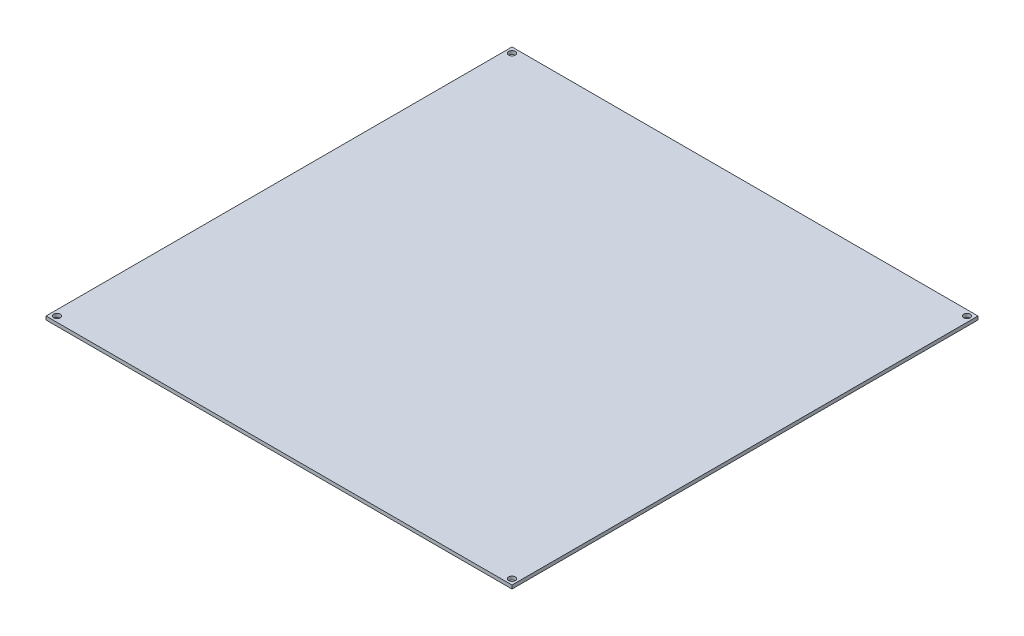
ISO-10303-21;
HEADER;
FILE_DESCRIPTION(('STEP AP214'),'2;1');
FILE_NAME('part.step','',(''),(''),'','','');
FILE_SCHEMA(('AUTOMOTIVE_DESIGN { 1 0 10303 214 1 1 1 1 }'));
ENDSEC;
DATA;
#1=APPLICATION_CONTEXT('core data for automotive mechanical design processes');
#2=APPLICATION_PROTOCOL_DEFINITION('international standard','automotive_design',2000,#1);
#3=PRODUCT_CONTEXT('',#1,'mechanical');
#4=PRODUCT('Part','Part','',(#3));
#5=PRODUCT_RELATED_PRODUCT_CATEGORY('part','',(#4));
#6=PRODUCT_DEFINITION_FORMATION('','',#4);
#7=PRODUCT_DEFINITION_CONTEXT('part definition',#1,'design');
#8=PRODUCT_DEFINITION('design','',#6,#7);
#9=PRODUCT_DEFINITION_SHAPE('','',#8);
#10=(LENGTH_UNIT() NAMED_UNIT(*) SI_UNIT(.MILLI.,.METRE.));
#11=(NAMED_UNIT(*) PLANE_ANGLE_UNIT() SI_UNIT($,.RADIAN.));
#12=(NAMED_UNIT(*) SI_UNIT($,.STERADIAN.) SOLID_ANGLE_UNIT());
#13=UNCERTAINTY_MEASURE_WITH_UNIT(LENGTH_MEASURE(1.E-05),#10,'distance_accuracy_value','');
#14=(GEOMETRIC_REPRESENTATION_CONTEXT(3) GLOBAL_UNCERTAINTY_ASSIGNED_CONTEXT((#13)) GLOBAL_UNIT_ASSIGNED_CONTEXT((#10,
#11,#12)) REPRESENTATION_CONTEXT('',''));
#15=CARTESIAN_POINT('',(0.,0.,0.));
#16=DIRECTION('',(0.,0.,1.));
#17=DIRECTION('',(1.,0.,0.));
#18=AXIS2_PLACEMENT_3D('',#15,#16,#17);
#19=CARTESIAN_POINT('',(0.,-5.4,0.));
#20=DIRECTION('',(0.,1.,0.));
#21=DIRECTION('',(0.,0.,1.));
#22=AXIS2_PLACEMENT_3D('',#19,#20,#21);
#23=PLANE('',#22);
#24=CARTESIAN_POINT('',(-104.5,-5.4,-104.5));
#25=DIRECTION('',(0.,1.,0.));
#26=DIRECTION('',(0.,0.,1.));
#27=AXIS2_PLACEMENT_3D('',#24,#25,#26);
#28=CIRCLE('',#27,1.5);
#29=CARTESIAN_POINT('',(-104.5,-5.4,-103.));
#30=VERTEX_POINT('',#29);
#31=EDGE_CURVE('E121',#30,#30,#28,.T.);
#32=ORIENTED_EDGE('',*,*,#31,.F.);
#33=EDGE_LOOP('',(#32));
#34=FACE_BOUND('',#33,.T.);
#35=CARTESIAN_POINT('',(104.5,-5.4,-104.5));
#36=DIRECTION('',(0.,1.,0.));
#37=DIRECTION('',(0.,0.,1.));
#38=AXIS2_PLACEMENT_3D('',#35,#36,#37);
#39=CIRCLE('',#38,1.5);
#40=CARTESIAN_POINT('',(104.5,-5.4,-103.));
#41=VERTEX_POINT('',#40);
#42=EDGE_CURVE('E100',#41,#41,#39,.T.);
#43=ORIENTED_EDGE('',*,*,#42,.F.);
#44=EDGE_LOOP('',(#43));
#45=FACE_BOUND('',#44,.T.);
#46=DIRECTION('',(0.,0.,1.));
#47=VECTOR('',#46,1.);
#48=CARTESIAN_POINT('',(-107.,-5.4,-107.));
#49=LINE('',#48,#47);
#50=CARTESIAN_POINT('',(-107.,-5.4,-107.));
#51=VERTEX_POINT('',#50);
#52=CARTESIAN_POINT('',(-107.,-5.4,107.));
#53=VERTEX_POINT('',#52);
#54=EDGE_CURVE('E85',#51,#53,#49,.T.);
#55=ORIENTED_EDGE('',*,*,#54,.T.);
#56=DIRECTION('',(1.,0.,0.));
#57=VECTOR('',#56,1.);
#58=CARTESIAN_POINT('',(-107.,-5.4,107.));
#59=LINE('',#58,#57);
#60=CARTESIAN_POINT('',(107.,-5.4,107.));
#61=VERTEX_POINT('',#60);
#62=EDGE_CURVE('E80',#53,#61,#59,.T.);
#63=ORIENTED_EDGE('',*,*,#62,.T.);
#64=DIRECTION('',(0.,0.,-1.));
#65=VECTOR('',#64,1.);
#66=CARTESIAN_POINT('',(107.,-5.4,-107.));
#67=LINE('',#66,#65);
#68=CARTESIAN_POINT('',(107.,-5.4,-107.));
#69=VERTEX_POINT('',#68);
#70=EDGE_CURVE('E83',#61,#69,#67,.T.);
#71=ORIENTED_EDGE('',*,*,#70,.T.);
#72=DIRECTION('',(-1.,0.,0.));
#73=VECTOR('',#72,1.);
#74=CARTESIAN_POINT('',(-107.,-5.4,-107.));
#75=LINE('',#74,#73);
#76=EDGE_CURVE('E50',#69,#51,#75,.T.);
#77=ORIENTED_EDGE('',*,*,#76,.T.);
#78=EDGE_LOOP('',(#55,#63,#71,#77));
#79=FACE_BOUND('',#78,.T.);
#80=CARTESIAN_POINT('',(104.5,-5.4,104.5));
#81=DIRECTION('',(0.,1.,0.));
#82=DIRECTION('',(0.,0.,1.));
#83=AXIS2_PLACEMENT_3D('',#80,#81,#82);
#84=CIRCLE('',#83,1.5);
#85=CARTESIAN_POINT('',(104.5,-5.4,106.));
#86=VERTEX_POINT('',#85);
#87=EDGE_CURVE('E115',#86,#86,#84,.T.);
#88=ORIENTED_EDGE('',*,*,#87,.F.);
#89=EDGE_LOOP('',(#88));
#90=FACE_BOUND('',#89,.T.);
#91=CARTESIAN_POINT('',(-104.5,-5.4,104.5));
#92=DIRECTION('',(0.,1.,0.));
#93=DIRECTION('',(0.,0.,1.));
#94=AXIS2_PLACEMENT_3D('',#91,#92,#93);
#95=CIRCLE('',#94,1.5);
#96=CARTESIAN_POINT('',(-104.5,-5.4,106.));
#97=VERTEX_POINT('',#96);
#98=EDGE_CURVE('E127',#97,#97,#95,.T.);
#99=ORIENTED_EDGE('',*,*,#98,.F.);
#100=EDGE_LOOP('',(#99));
#101=FACE_BOUND('',#100,.T.);
#102=ADVANCED_FACE('F33',(#34,#45,#79,#90,#101),#23,.T.);
#103=CARTESIAN_POINT('',(0.,-7.,0.));
#104=DIRECTION('',(0.,1.,0.));
#105=DIRECTION('',(0.,0.,1.));
#106=AXIS2_PLACEMENT_3D('',#103,#104,#105);
#107=PLANE('',#106);
#108=CARTESIAN_POINT('',(-104.5,-7.,-104.5));
#109=DIRECTION('',(0.,1.,0.));
#110=DIRECTION('',(0.,0.,1.));
#111=AXIS2_PLACEMENT_3D('',#108,#109,#110);
#112=CIRCLE('',#111,1.5);
#113=CARTESIAN_POINT('',(-104.5,-7.,-103.));
#114=VERTEX_POINT('',#113);
#115=EDGE_CURVE('E124',#114,#114,#112,.T.);
#116=ORIENTED_EDGE('',*,*,#115,.T.);
#117=EDGE_LOOP('',(#116));
#118=FACE_BOUND('',#117,.T.);
#119=CARTESIAN_POINT('',(104.5,-7.,-104.5));
#120=DIRECTION('',(0.,1.,0.));
#121=DIRECTION('',(0.,0.,1.));
#122=AXIS2_PLACEMENT_3D('',#119,#120,#121);
#123=CIRCLE('',#122,1.5);
#124=CARTESIAN_POINT('',(104.5,-7.,-103.));
#125=VERTEX_POINT('',#124);
#126=EDGE_CURVE('E112',#125,#125,#123,.T.);
#127=ORIENTED_EDGE('',*,*,#126,.T.);
#128=EDGE_LOOP('',(#127));
#129=FACE_BOUND('',#128,.T.);
#130=DIRECTION('',(0.,0.,1.));
#131=VECTOR('',#130,1.);
#132=CARTESIAN_POINT('',(-107.,-7.,-107.));
#133=LINE('',#132,#131);
#134=CARTESIAN_POINT('',(-107.,-7.,-107.));
#135=VERTEX_POINT('',#134);
#136=CARTESIAN_POINT('',(-107.,-7.,107.));
#137=VERTEX_POINT('',#136);
#138=EDGE_CURVE('E97',#135,#137,#133,.T.);
#139=ORIENTED_EDGE('',*,*,#138,.F.);
#140=DIRECTION('',(-1.,0.,0.));
#141=VECTOR('',#140,1.);
#142=CARTESIAN_POINT('',(-107.,-7.,-107.));
#143=LINE('',#142,#141);
#144=CARTESIAN_POINT('',(107.,-7.,-107.));
#145=VERTEX_POINT('',#144);
#146=EDGE_CURVE('E73',#145,#135,#143,.T.);
#147=ORIENTED_EDGE('',*,*,#146,.F.);
#148=DIRECTION('',(0.,0.,-1.));
#149=VECTOR('',#148,1.);
#150=CARTESIAN_POINT('',(107.,-7.,-107.));
#151=LINE('',#150,#149);
#152=CARTESIAN_POINT('',(107.,-7.,107.));
#153=VERTEX_POINT('',#152);
#154=EDGE_CURVE('E67',#153,#145,#151,.T.);
#155=ORIENTED_EDGE('',*,*,#154,.F.);
#156=DIRECTION('',(1.,0.,0.));
#157=VECTOR('',#156,1.);
#158=CARTESIAN_POINT('',(-107.,-7.,107.));
#159=LINE('',#158,#157);
#160=EDGE_CURVE('E89',#137,#153,#159,.T.);
#161=ORIENTED_EDGE('',*,*,#160,.F.);
#162=EDGE_LOOP('',(#139,#147,#155,#161));
#163=FACE_BOUND('',#162,.T.);
#164=CARTESIAN_POINT('',(104.5,-7.,104.5));
#165=DIRECTION('',(0.,1.,0.));
#166=DIRECTION('',(0.,0.,1.));
#167=AXIS2_PLACEMENT_3D('',#164,#165,#166);
#168=CIRCLE('',#167,1.5);
#169=CARTESIAN_POINT('',(104.5,-7.,106.));
#170=VERTEX_POINT('',#169);
#171=EDGE_CURVE('E118',#170,#170,#168,.T.);
#172=ORIENTED_EDGE('',*,*,#171,.T.);
#173=EDGE_LOOP('',(#172));
#174=FACE_BOUND('',#173,.T.);
#175=CARTESIAN_POINT('',(-104.5,-7.,104.5));
#176=DIRECTION('',(0.,1.,0.));
#177=DIRECTION('',(0.,0.,1.));
#178=AXIS2_PLACEMENT_3D('',#175,#176,#177);
#179=CIRCLE('',#178,1.5);
#180=CARTESIAN_POINT('',(-104.5,-7.,106.));
#181=VERTEX_POINT('',#180);
#182=EDGE_CURVE('E130',#181,#181,#179,.T.);
#183=ORIENTED_EDGE('',*,*,#182,.T.);
#184=EDGE_LOOP('',(#183));
#185=FACE_BOUND('',#184,.T.);
#186=ADVANCED_FACE('F108',(#118,#129,#163,#174,#185),#107,.F.);
#187=CARTESIAN_POINT('',(-107.,-5.4,-107.));
#188=DIRECTION('',(1.,0.,0.));
#189=DIRECTION('',(0.,0.,-1.));
#190=AXIS2_PLACEMENT_3D('',#187,#188,#189);
#191=PLANE('',#190);
#192=ORIENTED_EDGE('',*,*,#138,.T.);
#193=DIRECTION('',(0.,-1.,0.));
#194=VECTOR('',#193,1.);
#195=CARTESIAN_POINT('',(-107.,-5.4,107.));
#196=LINE('',#195,#194);
#197=EDGE_CURVE('E11',#53,#137,#196,.T.);
#198=ORIENTED_EDGE('',*,*,#197,.F.);
#199=ORIENTED_EDGE('',*,*,#54,.F.);
#200=DIRECTION('',(0.,-1.,0.));
#201=VECTOR('',#200,1.);
#202=CARTESIAN_POINT('',(-107.,-5.4,-107.));
#203=LINE('',#202,#201);
#204=EDGE_CURVE('E93',#51,#135,#203,.T.);
#205=ORIENTED_EDGE('',*,*,#204,.T.);
#206=EDGE_LOOP('',(#192,#198,#199,#205));
#207=FACE_BOUND('',#206,.T.);
#208=ADVANCED_FACE('F35',(#207),#191,.F.);
#209=CARTESIAN_POINT('',(-107.,-5.4,107.));
#210=DIRECTION('',(0.,0.,-1.));
#211=DIRECTION('',(-1.,0.,0.));
#212=AXIS2_PLACEMENT_3D('',#209,#210,#211);
#213=PLANE('',#212);
#214=ORIENTED_EDGE('',*,*,#160,.T.);
#215=DIRECTION('',(0.,-1.,0.));
#216=VECTOR('',#215,1.);
#217=CARTESIAN_POINT('',(107.,-5.4,107.));
#218=LINE('',#217,#216);
#219=EDGE_CURVE('E42',#61,#153,#218,.T.);
#220=ORIENTED_EDGE('',*,*,#219,.F.);
#221=ORIENTED_EDGE('',*,*,#62,.F.);
#222=ORIENTED_EDGE('',*,*,#197,.T.);
#223=EDGE_LOOP('',(#214,#220,#221,#222));
#224=FACE_BOUND('',#223,.T.);
#225=ADVANCED_FACE('F88',(#224),#213,.F.);
#226=CARTESIAN_POINT('',(107.,-5.4,-107.));
#227=DIRECTION('',(-1.,0.,0.));
#228=DIRECTION('',(0.,0.,1.));
#229=AXIS2_PLACEMENT_3D('',#226,#227,#228);
#230=PLANE('',#229);
#231=ORIENTED_EDGE('',*,*,#154,.T.);
#232=DIRECTION('',(0.,-1.,0.));
#233=VECTOR('',#232,1.);
#234=CARTESIAN_POINT('',(107.,-5.4,-107.));
#235=LINE('',#234,#233);
#236=EDGE_CURVE('E90',#69,#145,#235,.T.);
#237=ORIENTED_EDGE('',*,*,#236,.F.);
#238=ORIENTED_EDGE('',*,*,#70,.F.);
#239=ORIENTED_EDGE('',*,*,#219,.T.);
#240=EDGE_LOOP('',(#231,#237,#238,#239));
#241=FACE_BOUND('',#240,.T.);
#242=ADVANCED_FACE('F91',(#241),#230,.F.);
#243=CARTESIAN_POINT('',(-107.,-5.4,-107.));
#244=DIRECTION('',(0.,0.,1.));
#245=DIRECTION('',(1.,0.,0.));
#246=AXIS2_PLACEMENT_3D('',#243,#244,#245);
#247=PLANE('',#246);
#248=ORIENTED_EDGE('',*,*,#146,.T.);
#249=ORIENTED_EDGE('',*,*,#204,.F.);
#250=ORIENTED_EDGE('',*,*,#76,.F.);
#251=ORIENTED_EDGE('',*,*,#236,.T.);
#252=EDGE_LOOP('',(#248,#249,#250,#251));
#253=FACE_BOUND('',#252,.T.);
#254=ADVANCED_FACE('F105',(#253),#247,.F.);
#255=CARTESIAN_POINT('',(104.5,-5.4,-104.5));
#256=DIRECTION('',(0.,-1.,0.));
#257=DIRECTION('',(0.,0.,-1.));
#258=AXIS2_PLACEMENT_3D('',#255,#256,#257);
#259=CYLINDRICAL_SURFACE('',#258,1.5);
#260=ORIENTED_EDGE('',*,*,#42,.T.);
#261=EDGE_LOOP('',(#260));
#262=FACE_BOUND('',#261,.T.);
#263=ORIENTED_EDGE('',*,*,#126,.F.);
#264=EDGE_LOOP('',(#263));
#265=FACE_BOUND('',#264,.T.);
#266=ADVANCED_FACE('F150',(#262,#265),#259,.F.);
#267=CARTESIAN_POINT('',(104.5,-5.4,104.5));
#268=DIRECTION('',(0.,-1.,0.));
#269=DIRECTION('',(0.,0.,-1.));
#270=AXIS2_PLACEMENT_3D('',#267,#268,#269);
#271=CYLINDRICAL_SURFACE('',#270,1.5);
#272=ORIENTED_EDGE('',*,*,#87,.T.);
#273=EDGE_LOOP('',(#272));
#274=FACE_BOUND('',#273,.T.);
#275=ORIENTED_EDGE('',*,*,#171,.F.);
#276=EDGE_LOOP('',(#275));
#277=FACE_BOUND('',#276,.T.);
#278=ADVANCED_FACE('F195',(#274,#277),#271,.F.);
#279=CARTESIAN_POINT('',(-104.5,-5.4,-104.5));
#280=DIRECTION('',(0.,-1.,0.));
#281=DIRECTION('',(0.,0.,-1.));
#282=AXIS2_PLACEMENT_3D('',#279,#280,#281);
#283=CYLINDRICAL_SURFACE('',#282,1.5);
#284=ORIENTED_EDGE('',*,*,#31,.T.);
#285=EDGE_LOOP('',(#284));
#286=FACE_BOUND('',#285,.T.);
#287=ORIENTED_EDGE('',*,*,#115,.F.);
#288=EDGE_LOOP('',(#287));
#289=FACE_BOUND('',#288,.T.);
#290=ADVANCED_FACE('F203',(#286,#289),#283,.F.);
#291=CARTESIAN_POINT('',(-104.5,-5.4,104.5));
#292=DIRECTION('',(0.,-1.,0.));
#293=DIRECTION('',(0.,0.,-1.));
#294=AXIS2_PLACEMENT_3D('',#291,#292,#293);
#295=CYLINDRICAL_SURFACE('',#294,1.5);
#296=ORIENTED_EDGE('',*,*,#98,.T.);
#297=EDGE_LOOP('',(#296));
#298=FACE_BOUND('',#297,.T.);
#299=ORIENTED_EDGE('',*,*,#182,.F.);
#300=EDGE_LOOP('',(#299));
#301=FACE_BOUND('',#300,.T.);
#302=ADVANCED_FACE('F136',(#298,#301),#295,.F.);
#303=CLOSED_SHELL('',(#102,#186,#208,#225,#242,#254,#266,#278,#290,#302));
#304=MANIFOLD_SOLID_BREP('B2',#303);
#305=ADVANCED_BREP_SHAPE_REPRESENTATION('',(#18,#304),#14);
#306=SHAPE_DEFINITION_REPRESENTATION(#9,#305);
ENDSEC;
END-ISO-10303-21;
